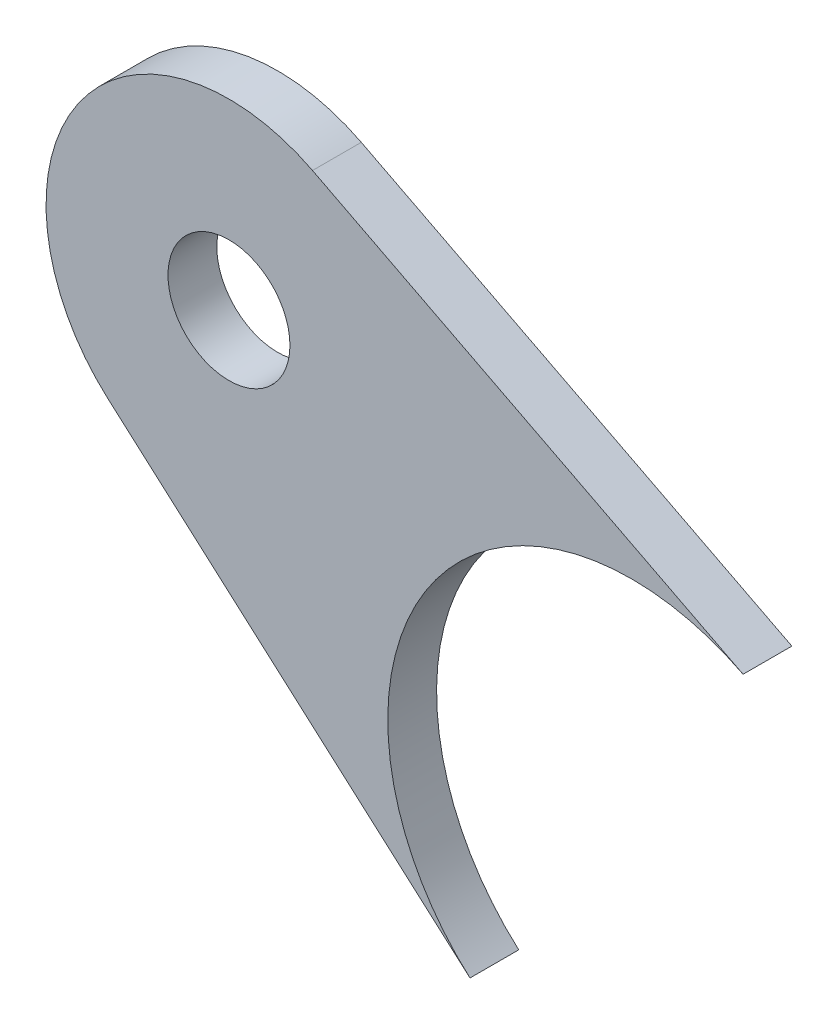
ISO-10303-21;
HEADER;
FILE_DESCRIPTION(('STEP AP214'),'2;1');
FILE_NAME('part.step','',(''),(''),'','','');
FILE_SCHEMA(('AUTOMOTIVE_DESIGN { 1 0 10303 214 1 1 1 1 }'));
ENDSEC;
DATA;
#1=APPLICATION_CONTEXT('core data for automotive mechanical design processes');
#2=APPLICATION_PROTOCOL_DEFINITION('international standard','automotive_design',2000,#1);
#3=PRODUCT_CONTEXT('',#1,'mechanical');
#4=PRODUCT('Part','Part','',(#3));
#5=PRODUCT_RELATED_PRODUCT_CATEGORY('part','',(#4));
#6=PRODUCT_DEFINITION_FORMATION('','',#4);
#7=PRODUCT_DEFINITION_CONTEXT('part definition',#1,'design');
#8=PRODUCT_DEFINITION('design','',#6,#7);
#9=PRODUCT_DEFINITION_SHAPE('','',#8);
#10=(LENGTH_UNIT() NAMED_UNIT(*) SI_UNIT(.MILLI.,.METRE.));
#11=(NAMED_UNIT(*) PLANE_ANGLE_UNIT() SI_UNIT($,.RADIAN.));
#12=(NAMED_UNIT(*) SI_UNIT($,.STERADIAN.) SOLID_ANGLE_UNIT());
#13=UNCERTAINTY_MEASURE_WITH_UNIT(LENGTH_MEASURE(1.E-05),#10,'distance_accuracy_value','');
#14=(GEOMETRIC_REPRESENTATION_CONTEXT(3) GLOBAL_UNCERTAINTY_ASSIGNED_CONTEXT((#13)) GLOBAL_UNIT_ASSIGNED_CONTEXT((#10,
#11,#12)) REPRESENTATION_CONTEXT('',''));
#15=CARTESIAN_POINT('',(0.,0.,0.));
#16=DIRECTION('',(0.,0.,1.));
#17=DIRECTION('',(1.,0.,0.));
#18=AXIS2_PLACEMENT_3D('',#15,#16,#17);
#19=CARTESIAN_POINT('',(-1427.27094631226,187.05248858996,39.3319));
#20=DIRECTION('',(0.,0.,-1.));
#21=DIRECTION('',(-1.,0.,0.));
#22=AXIS2_PLACEMENT_3D('',#19,#20,#21);
#23=CYLINDRICAL_SURFACE('',#22,9.52499999999997);
#24=CARTESIAN_POINT('',(-1427.27094631226,187.05248858996,36.7919));
#25=DIRECTION('',(0.,0.,1.));
#26=DIRECTION('',(1.,0.,0.));
#27=AXIS2_PLACEMENT_3D('',#24,#25,#26);
#28=CIRCLE('',#27,9.52499999999997);
#29=CARTESIAN_POINT('',(-1433.58644199239,179.922261432688,36.7919));
#30=VERTEX_POINT('',#29);
#31=CARTESIAN_POINT('',(-1422.92138560803,195.526386552541,36.7919));
#32=VERTEX_POINT('',#31);
#33=EDGE_CURVE('E103',#30,#32,#28,.F.);
#34=ORIENTED_EDGE('',*,*,#33,.F.);
#35=DIRECTION('',(0.,0.,-1.));
#36=VECTOR('',#35,1.);
#37=CARTESIAN_POINT('',(-1433.58644199239,179.922261432688,39.3319));
#38=LINE('',#37,#36);
#39=CARTESIAN_POINT('',(-1433.58644199239,179.922261432688,39.3319));
#40=VERTEX_POINT('',#39);
#41=EDGE_CURVE('E11',#40,#30,#38,.T.);
#42=ORIENTED_EDGE('',*,*,#41,.F.);
#43=CARTESIAN_POINT('',(-1427.27094631226,187.05248858996,39.3319));
#44=DIRECTION('',(0.,0.,1.));
#45=DIRECTION('',(1.,0.,0.));
#46=AXIS2_PLACEMENT_3D('',#43,#44,#45);
#47=CIRCLE('',#46,9.52499999999997);
#48=CARTESIAN_POINT('',(-1422.92138560803,195.526386552541,39.3319));
#49=VERTEX_POINT('',#48);
#50=EDGE_CURVE('E93',#40,#49,#47,.F.);
#51=ORIENTED_EDGE('',*,*,#50,.T.);
#52=DIRECTION('',(0.,0.,-1.));
#53=VECTOR('',#52,1.);
#54=CARTESIAN_POINT('',(-1422.92138560803,195.526386552541,39.3319));
#55=LINE('',#54,#53);
#56=EDGE_CURVE('E75',#49,#32,#55,.T.);
#57=ORIENTED_EDGE('',*,*,#56,.T.);
#58=EDGE_LOOP('',(#34,#42,#51,#57));
#59=FACE_BOUND('',#58,.T.);
#60=ADVANCED_FACE('F36',(#59),#23,.T.);
#61=CARTESIAN_POINT('',(-540.941181332143,-610.725380393907,39.3319));
#62=DIRECTION('',(-0.663044165892556,-0.748580278978713,0.));
#63=DIRECTION('',(0.748580278978713,-0.663044165892556,0.));
#64=AXIS2_PLACEMENT_3D('',#61,#62,#63);
#65=PLANE('',#64);
#66=DIRECTION('',(-0.748580278978713,0.663044165892556,0.));
#67=VECTOR('',#66,1.);
#68=CARTESIAN_POINT('',(-540.941181332143,-610.725380393907,36.7919));
#69=LINE('',#68,#67);
#70=CARTESIAN_POINT('',(-1414.72163414285,163.21303045697,36.7919));
#71=VERTEX_POINT('',#70);
#72=EDGE_CURVE('E86',#71,#30,#69,.T.);
#73=ORIENTED_EDGE('',*,*,#72,.F.);
#74=DIRECTION('',(0.,0.,-1.));
#75=VECTOR('',#74,1.);
#76=CARTESIAN_POINT('',(-1414.72163414285,163.21303045697,39.3319));
#77=LINE('',#76,#75);
#78=CARTESIAN_POINT('',(-1414.72163414285,163.21303045697,39.3319));
#79=VERTEX_POINT('',#78);
#80=EDGE_CURVE('E45',#79,#71,#77,.T.);
#81=ORIENTED_EDGE('',*,*,#80,.F.);
#82=DIRECTION('',(-0.748580278978713,0.663044165892556,0.));
#83=VECTOR('',#82,1.);
#84=CARTESIAN_POINT('',(-540.941181332143,-610.725380393907,39.3319));
#85=LINE('',#84,#83);
#86=EDGE_CURVE('E84',#79,#40,#85,.T.);
#87=ORIENTED_EDGE('',*,*,#86,.T.);
#88=ORIENTED_EDGE('',*,*,#41,.T.);
#89=EDGE_LOOP('',(#73,#81,#87,#88));
#90=FACE_BOUND('',#89,.T.);
#91=ADVANCED_FACE('F83',(#90),#65,.T.);
#92=CARTESIAN_POINT('',(-1406.30097323601,172.72,39.3319));
#93=DIRECTION('',(0.,0.,-1.));
#94=DIRECTION('',(-1.,0.,0.));
#95=AXIS2_PLACEMENT_3D('',#92,#93,#94);
#96=CYLINDRICAL_SURFACE('',#95,12.6999999999999);
#97=CARTESIAN_POINT('',(-1406.30097323601,172.72,36.7919));
#98=DIRECTION('',(0.,0.,1.));
#99=DIRECTION('',(1.,0.,0.));
#100=AXIS2_PLACEMENT_3D('',#97,#98,#99);
#101=CIRCLE('',#100,12.6999999999999);
#102=CARTESIAN_POINT('',(-1400.50155896371,184.018530616775,36.7919));
#103=VERTEX_POINT('',#102);
#104=EDGE_CURVE('E107',#103,#71,#101,.T.);
#105=ORIENTED_EDGE('',*,*,#104,.F.);
#106=DIRECTION('',(0.,0.,-1.));
#107=VECTOR('',#106,1.);
#108=CARTESIAN_POINT('',(-1400.50155896371,184.018530616775,39.3319));
#109=LINE('',#108,#107);
#110=CARTESIAN_POINT('',(-1400.50155896371,184.018530616775,39.3319));
#111=VERTEX_POINT('',#110);
#112=EDGE_CURVE('E68',#111,#103,#109,.T.);
#113=ORIENTED_EDGE('',*,*,#112,.F.);
#114=CARTESIAN_POINT('',(-1406.30097323601,172.72,39.3319));
#115=DIRECTION('',(0.,0.,1.));
#116=DIRECTION('',(1.,0.,0.));
#117=AXIS2_PLACEMENT_3D('',#114,#115,#116);
#118=CIRCLE('',#117,12.6999999999999);
#119=EDGE_CURVE('E92',#111,#79,#118,.T.);
#120=ORIENTED_EDGE('',*,*,#119,.T.);
#121=ORIENTED_EDGE('',*,*,#80,.T.);
#122=EDGE_LOOP('',(#105,#113,#120,#121));
#123=FACE_BOUND('',#122,.T.);
#124=ADVANCED_FACE('F95',(#123),#96,.F.);
#125=CARTESIAN_POINT('',(-1427.27094631226,187.05248858996,39.3319));
#126=DIRECTION('',(0.,0.,-1.));
#127=DIRECTION('',(-1.,0.,0.));
#128=AXIS2_PLACEMENT_3D('',#125,#126,#127);
#129=CYLINDRICAL_SURFACE('',#128,3.17499999999986);
#130=CARTESIAN_POINT('',(-1427.27094631226,187.05248858996,39.3319));
#131=DIRECTION('',(0.,0.,1.));
#132=DIRECTION('',(1.,0.,0.));
#133=AXIS2_PLACEMENT_3D('',#130,#131,#132);
#134=CIRCLE('',#133,3.17499999999986);
#135=CARTESIAN_POINT('',(-1424.09594631226,187.05248858996,39.3319));
#136=VERTEX_POINT('',#135);
#137=EDGE_CURVE('E111',#136,#136,#134,.T.);
#138=ORIENTED_EDGE('',*,*,#137,.T.);
#139=EDGE_LOOP('',(#138));
#140=FACE_BOUND('',#139,.T.);
#141=CARTESIAN_POINT('',(-1427.27094631226,187.05248858996,36.7919));
#142=DIRECTION('',(0.,0.,1.));
#143=DIRECTION('',(1.,0.,0.));
#144=AXIS2_PLACEMENT_3D('',#141,#142,#143);
#145=CIRCLE('',#144,3.17499999999986);
#146=CARTESIAN_POINT('',(-1424.09594631226,187.05248858996,36.7919));
#147=VERTEX_POINT('',#146);
#148=EDGE_CURVE('E100',#147,#147,#145,.T.);
#149=ORIENTED_EDGE('',*,*,#148,.F.);
#150=EDGE_LOOP('',(#149));
#151=FACE_BOUND('',#150,.T.);
#152=ADVANCED_FACE('F38',(#140,#151),#129,.F.);
#153=CARTESIAN_POINT('',(-217.282961713701,-423.314852182542,39.3319));
#154=DIRECTION('',(-0.456646793094817,-0.889648080060999,0.));
#155=DIRECTION('',(0.889648080060999,-0.456646793094817,0.));
#156=AXIS2_PLACEMENT_3D('',#153,#154,#155);
#157=PLANE('',#156);
#158=DIRECTION('',(-0.889648080060999,0.456646793094817,0.));
#159=VECTOR('',#158,1.);
#160=CARTESIAN_POINT('',(-217.282961713701,-423.314852182542,36.7919));
#161=LINE('',#160,#159);
#162=EDGE_CURVE('E109',#103,#32,#161,.T.);
#163=ORIENTED_EDGE('',*,*,#162,.T.);
#164=ORIENTED_EDGE('',*,*,#56,.F.);
#165=DIRECTION('',(-0.889648080060999,0.456646793094817,0.));
#166=VECTOR('',#165,1.);
#167=CARTESIAN_POINT('',(-217.282961713701,-423.314852182542,39.3319));
#168=LINE('',#167,#166);
#169=EDGE_CURVE('E53',#111,#49,#168,.T.);
#170=ORIENTED_EDGE('',*,*,#169,.F.);
#171=ORIENTED_EDGE('',*,*,#112,.T.);
#172=EDGE_LOOP('',(#163,#164,#170,#171));
#173=FACE_BOUND('',#172,.T.);
#174=ADVANCED_FACE('F125',(#173),#157,.F.);
#175=CARTESIAN_POINT('',(1.55431223447522E-12,-5.27355936696949E-13,39.3319));
#176=DIRECTION('',(0.,0.,1.));
#177=DIRECTION('',(1.,0.,0.));
#178=AXIS2_PLACEMENT_3D('',#175,#176,#177);
#179=PLANE('',#178);
#180=ORIENTED_EDGE('',*,*,#137,.F.);
#181=EDGE_LOOP('',(#180));
#182=FACE_BOUND('',#181,.T.);
#183=ORIENTED_EDGE('',*,*,#50,.F.);
#184=ORIENTED_EDGE('',*,*,#86,.F.);
#185=ORIENTED_EDGE('',*,*,#119,.F.);
#186=ORIENTED_EDGE('',*,*,#169,.T.);
#187=EDGE_LOOP('',(#183,#184,#185,#186));
#188=FACE_BOUND('',#187,.T.);
#189=ADVANCED_FACE('F91',(#182,#188),#179,.T.);
#190=CARTESIAN_POINT('',(1.55431223447522E-12,-5.27355936696949E-13,36.7919));
#191=DIRECTION('',(0.,0.,1.));
#192=DIRECTION('',(1.,0.,0.));
#193=AXIS2_PLACEMENT_3D('',#190,#191,#192);
#194=PLANE('',#193);
#195=ORIENTED_EDGE('',*,*,#148,.T.);
#196=EDGE_LOOP('',(#195));
#197=FACE_BOUND('',#196,.T.);
#198=ORIENTED_EDGE('',*,*,#33,.T.);
#199=ORIENTED_EDGE('',*,*,#162,.F.);
#200=ORIENTED_EDGE('',*,*,#104,.T.);
#201=ORIENTED_EDGE('',*,*,#72,.T.);
#202=EDGE_LOOP('',(#198,#199,#200,#201));
#203=FACE_BOUND('',#202,.T.);
#204=ADVANCED_FACE('F128',(#197,#203),#194,.F.);
#205=CLOSED_SHELL('',(#60,#91,#124,#152,#174,#189,#204));
#206=MANIFOLD_SOLID_BREP('B2',#205);
#207=ADVANCED_BREP_SHAPE_REPRESENTATION('',(#18,#206),#14);
#208=SHAPE_DEFINITION_REPRESENTATION(#9,#207);
ENDSEC;
END-ISO-10303-21;
